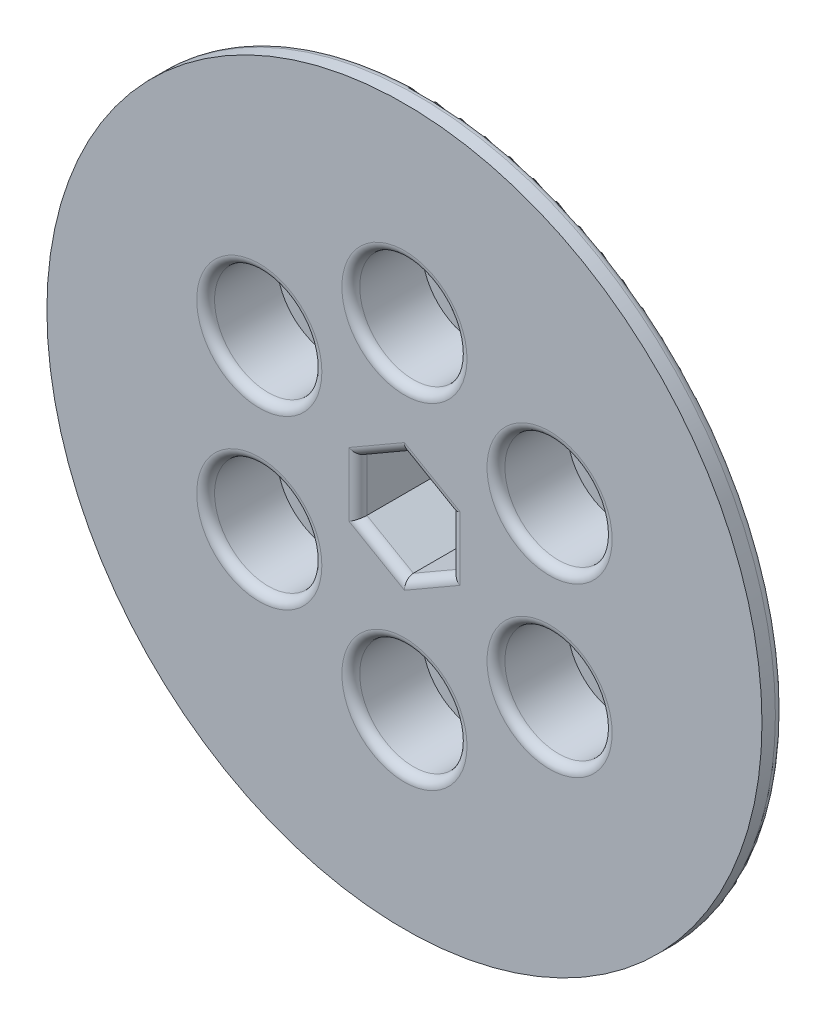
ISO-10303-21;
HEADER;
FILE_DESCRIPTION(('STEP AP214'),'2;1');
FILE_NAME('part.step','',(''),(''),'','','');
FILE_SCHEMA(('AUTOMOTIVE_DESIGN { 1 0 10303 214 1 1 1 1 }'));
ENDSEC;
DATA;
#1=APPLICATION_CONTEXT('core data for automotive mechanical design processes');
#2=APPLICATION_PROTOCOL_DEFINITION('international standard','automotive_design',2000,#1);
#3=PRODUCT_CONTEXT('',#1,'mechanical');
#4=PRODUCT('Part','Part','',(#3));
#5=PRODUCT_RELATED_PRODUCT_CATEGORY('part','',(#4));
#6=PRODUCT_DEFINITION_FORMATION('','',#4);
#7=PRODUCT_DEFINITION_CONTEXT('part definition',#1,'design');
#8=PRODUCT_DEFINITION('design','',#6,#7);
#9=PRODUCT_DEFINITION_SHAPE('','',#8);
#10=(LENGTH_UNIT() NAMED_UNIT(*) SI_UNIT(.MILLI.,.METRE.));
#11=(NAMED_UNIT(*) PLANE_ANGLE_UNIT() SI_UNIT($,.RADIAN.));
#12=(NAMED_UNIT(*) SI_UNIT($,.STERADIAN.) SOLID_ANGLE_UNIT());
#13=UNCERTAINTY_MEASURE_WITH_UNIT(LENGTH_MEASURE(1.E-05),#10,'distance_accuracy_value','');
#14=(GEOMETRIC_REPRESENTATION_CONTEXT(3) GLOBAL_UNCERTAINTY_ASSIGNED_CONTEXT((#13)) GLOBAL_UNIT_ASSIGNED_CONTEXT((#10,
#11,#12)) REPRESENTATION_CONTEXT('',''));
#15=CARTESIAN_POINT('',(0.,0.,0.));
#16=DIRECTION('',(0.,0.,1.));
#17=DIRECTION('',(1.,0.,0.));
#18=AXIS2_PLACEMENT_3D('',#15,#16,#17);
#19=CARTESIAN_POINT('',(20.6222299276166,11.9062499999994,15.876));
#20=DIRECTION('',(0.,0.,-1.));
#21=DIRECTION('',(-1.,0.,0.));
#22=AXIS2_PLACEMENT_3D('',#19,#20,#21);
#23=CYLINDRICAL_SURFACE('',#22,2.66700000000078);
#24=CARTESIAN_POINT('',(20.6222299276166,11.9062499999994,0.));
#25=DIRECTION('',(0.,0.,-1.));
#26=DIRECTION('',(-1.,0.,0.));
#27=AXIS2_PLACEMENT_3D('',#24,#25,#26);
#28=CIRCLE('',#27,2.66700000000078);
#29=CARTESIAN_POINT('',(17.9552299276158,11.9062499999994,0.));
#30=VERTEX_POINT('',#29);
#31=EDGE_CURVE('E165',#30,#30,#28,.T.);
#32=ORIENTED_EDGE('',*,*,#31,.T.);
#33=EDGE_LOOP('',(#32));
#34=FACE_BOUND('',#33,.T.);
#35=CARTESIAN_POINT('',(20.6222299276166,11.9062499999994,5.715));
#36=DIRECTION('',(0.,0.,1.));
#37=DIRECTION('',(1.,0.,0.));
#38=AXIS2_PLACEMENT_3D('',#35,#36,#37);
#39=CIRCLE('',#38,2.66700000000078);
#40=CARTESIAN_POINT('',(23.2892299276174,11.9062499999994,5.715));
#41=VERTEX_POINT('',#40);
#42=EDGE_CURVE('E168',#41,#41,#39,.F.);
#43=ORIENTED_EDGE('',*,*,#42,.F.);
#44=EDGE_LOOP('',(#43));
#45=FACE_BOUND('',#44,.T.);
#46=ADVANCED_FACE('F34',(#34,#45),#23,.F.);
#47=CARTESIAN_POINT('',(20.6222299276159,-11.9062500000006,15.876));
#48=DIRECTION('',(0.,0.,-1.));
#49=DIRECTION('',(-1.,0.,0.));
#50=AXIS2_PLACEMENT_3D('',#47,#48,#49);
#51=CYLINDRICAL_SURFACE('',#50,2.66700000000136);
#52=CARTESIAN_POINT('',(20.6222299276159,-11.9062500000006,0.));
#53=DIRECTION('',(0.,0.,-1.));
#54=DIRECTION('',(-1.,0.,0.));
#55=AXIS2_PLACEMENT_3D('',#52,#53,#54);
#56=CIRCLE('',#55,2.66700000000136);
#57=CARTESIAN_POINT('',(17.9552299276146,-11.9062500000006,0.));
#58=VERTEX_POINT('',#57);
#59=EDGE_CURVE('E162',#58,#58,#56,.T.);
#60=ORIENTED_EDGE('',*,*,#59,.T.);
#61=EDGE_LOOP('',(#60));
#62=FACE_BOUND('',#61,.T.);
#63=CARTESIAN_POINT('',(20.6222299276159,-11.9062500000006,5.715));
#64=DIRECTION('',(0.,0.,1.));
#65=DIRECTION('',(1.,0.,0.));
#66=AXIS2_PLACEMENT_3D('',#63,#64,#65);
#67=CIRCLE('',#66,2.66700000000136);
#68=CARTESIAN_POINT('',(23.2892299276173,-11.9062500000006,5.715));
#69=VERTEX_POINT('',#68);
#70=EDGE_CURVE('E193',#69,#69,#67,.F.);
#71=ORIENTED_EDGE('',*,*,#70,.F.);
#72=EDGE_LOOP('',(#71));
#73=FACE_BOUND('',#72,.T.);
#74=ADVANCED_FACE('F337',(#62,#73),#51,.F.);
#75=CARTESIAN_POINT('',(-1.34775153124205E-12,-23.8125,15.876));
#76=DIRECTION('',(0.,0.,-1.));
#77=DIRECTION('',(-1.,0.,0.));
#78=AXIS2_PLACEMENT_3D('',#75,#76,#77);
#79=CYLINDRICAL_SURFACE('',#78,2.66700000000145);
#80=CARTESIAN_POINT('',(-1.34775153124205E-12,-23.8125,0.));
#81=DIRECTION('',(0.,0.,-1.));
#82=DIRECTION('',(-1.,0.,0.));
#83=AXIS2_PLACEMENT_3D('',#80,#81,#82);
#84=CIRCLE('',#83,2.66700000000145);
#85=CARTESIAN_POINT('',(-2.6670000000028,-23.8125,0.));
#86=VERTEX_POINT('',#85);
#87=EDGE_CURVE('E159',#86,#86,#84,.T.);
#88=ORIENTED_EDGE('',*,*,#87,.T.);
#89=EDGE_LOOP('',(#88));
#90=FACE_BOUND('',#89,.T.);
#91=CARTESIAN_POINT('',(-1.34775153124205E-12,-23.8125,5.715));
#92=DIRECTION('',(0.,0.,1.));
#93=DIRECTION('',(1.,0.,0.));
#94=AXIS2_PLACEMENT_3D('',#91,#92,#93);
#95=CIRCLE('',#94,2.66700000000145);
#96=CARTESIAN_POINT('',(2.6670000000001,-23.8125,5.715));
#97=VERTEX_POINT('',#96);
#98=EDGE_CURVE('E190',#97,#97,#95,.F.);
#99=ORIENTED_EDGE('',*,*,#98,.F.);
#100=EDGE_LOOP('',(#99));
#101=FACE_BOUND('',#100,.T.);
#102=ADVANCED_FACE('F343',(#90,#101),#79,.F.);
#103=CARTESIAN_POINT('',(-20.622229927618,-11.9062499999994,15.876));
#104=DIRECTION('',(0.,0.,-1.));
#105=DIRECTION('',(-1.,0.,0.));
#106=AXIS2_PLACEMENT_3D('',#103,#104,#105);
#107=CYLINDRICAL_SURFACE('',#106,2.66700000000091);
#108=CARTESIAN_POINT('',(-20.622229927618,-11.9062499999994,0.));
#109=DIRECTION('',(0.,0.,-1.));
#110=DIRECTION('',(-1.,0.,0.));
#111=AXIS2_PLACEMENT_3D('',#108,#109,#110);
#112=CIRCLE('',#111,2.66700000000091);
#113=CARTESIAN_POINT('',(-23.2892299276189,-11.9062499999994,0.));
#114=VERTEX_POINT('',#113);
#115=EDGE_CURVE('E156',#114,#114,#112,.T.);
#116=ORIENTED_EDGE('',*,*,#115,.T.);
#117=EDGE_LOOP('',(#116));
#118=FACE_BOUND('',#117,.T.);
#119=CARTESIAN_POINT('',(-20.622229927618,-11.9062499999994,5.715));
#120=DIRECTION('',(0.,0.,1.));
#121=DIRECTION('',(1.,0.,0.));
#122=AXIS2_PLACEMENT_3D('',#119,#120,#121);
#123=CIRCLE('',#122,2.66700000000091);
#124=CARTESIAN_POINT('',(-17.9552299276171,-11.9062499999994,5.715));
#125=VERTEX_POINT('',#124);
#126=EDGE_CURVE('E187',#125,#125,#123,.F.);
#127=ORIENTED_EDGE('',*,*,#126,.F.);
#128=EDGE_LOOP('',(#127));
#129=FACE_BOUND('',#128,.T.);
#130=ADVANCED_FACE('F594',(#118,#129),#107,.F.);
#131=CARTESIAN_POINT('',(-20.6222299276173,11.9062500000006,15.876));
#132=DIRECTION('',(0.,0.,-1.));
#133=DIRECTION('',(-1.,0.,0.));
#134=AXIS2_PLACEMENT_3D('',#131,#132,#133);
#135=CYLINDRICAL_SURFACE('',#134,2.66700000000021);
#136=CARTESIAN_POINT('',(-20.6222299276173,11.9062500000006,0.));
#137=DIRECTION('',(0.,0.,-1.));
#138=DIRECTION('',(-1.,0.,0.));
#139=AXIS2_PLACEMENT_3D('',#136,#137,#138);
#140=CIRCLE('',#139,2.66700000000021);
#141=CARTESIAN_POINT('',(-23.2892299276175,11.9062500000006,0.));
#142=VERTEX_POINT('',#141);
#143=EDGE_CURVE('E153',#142,#142,#140,.T.);
#144=ORIENTED_EDGE('',*,*,#143,.T.);
#145=EDGE_LOOP('',(#144));
#146=FACE_BOUND('',#145,.T.);
#147=CARTESIAN_POINT('',(-20.6222299276173,11.9062500000006,5.715));
#148=DIRECTION('',(0.,0.,1.));
#149=DIRECTION('',(1.,0.,0.));
#150=AXIS2_PLACEMENT_3D('',#147,#148,#149);
#151=CIRCLE('',#150,2.66700000000021);
#152=CARTESIAN_POINT('',(-17.9552299276171,11.9062500000006,5.715));
#153=VERTEX_POINT('',#152);
#154=EDGE_CURVE('E183',#153,#153,#151,.F.);
#155=ORIENTED_EDGE('',*,*,#154,.F.);
#156=EDGE_LOOP('',(#155));
#157=FACE_BOUND('',#156,.T.);
#158=ADVANCED_FACE('F602',(#146,#157),#135,.F.);
#159=CARTESIAN_POINT('',(0.,23.8125,15.876));
#160=DIRECTION('',(0.,0.,-1.));
#161=DIRECTION('',(-1.,0.,0.));
#162=AXIS2_PLACEMENT_3D('',#159,#160,#161);
#163=CYLINDRICAL_SURFACE('',#162,2.667);
#164=CARTESIAN_POINT('',(0.,23.8125,0.));
#165=DIRECTION('',(0.,0.,-1.));
#166=DIRECTION('',(-1.,0.,0.));
#167=AXIS2_PLACEMENT_3D('',#164,#165,#166);
#168=CIRCLE('',#167,2.667);
#169=CARTESIAN_POINT('',(-2.667,23.8125,0.));
#170=VERTEX_POINT('',#169);
#171=EDGE_CURVE('E146',#170,#170,#168,.T.);
#172=ORIENTED_EDGE('',*,*,#171,.T.);
#173=EDGE_LOOP('',(#172));
#174=FACE_BOUND('',#173,.T.);
#175=CARTESIAN_POINT('',(0.,23.8125,5.715));
#176=DIRECTION('',(0.,0.,1.));
#177=DIRECTION('',(1.,0.,0.));
#178=AXIS2_PLACEMENT_3D('',#175,#176,#177);
#179=CIRCLE('',#178,2.667);
#180=CARTESIAN_POINT('',(2.667,23.8125,5.715));
#181=VERTEX_POINT('',#180);
#182=EDGE_CURVE('E180',#181,#181,#179,.F.);
#183=ORIENTED_EDGE('',*,*,#182,.F.);
#184=EDGE_LOOP('',(#183));
#185=FACE_BOUND('',#184,.T.);
#186=ADVANCED_FACE('F366',(#174,#185),#163,.F.);
#187=CARTESIAN_POINT('',(0.,0.,12.7));
#188=DIRECTION('',(0.,0.,-1.));
#189=DIRECTION('',(-1.,0.,0.));
#190=AXIS2_PLACEMENT_3D('',#187,#188,#189);
#191=CYLINDRICAL_SURFACE('',#190,31.75);
#192=CARTESIAN_POINT('',(0.,0.,12.7));
#193=DIRECTION('',(0.,0.,1.));
#194=DIRECTION('',(1.,0.,0.));
#195=AXIS2_PLACEMENT_3D('',#192,#193,#194);
#196=CIRCLE('',#195,31.75);
#197=CARTESIAN_POINT('',(31.75,0.,12.7));
#198=VERTEX_POINT('',#197);
#199=EDGE_CURVE('E174',#198,#198,#196,.T.);
#200=ORIENTED_EDGE('',*,*,#199,.F.);
#201=EDGE_LOOP('',(#200));
#202=FACE_BOUND('',#201,.T.);
#203=CARTESIAN_POINT('',(0.,0.,0.));
#204=DIRECTION('',(0.,0.,1.));
#205=DIRECTION('',(1.,0.,0.));
#206=AXIS2_PLACEMENT_3D('',#203,#204,#205);
#207=CIRCLE('',#206,31.75);
#208=CARTESIAN_POINT('',(31.75,0.,0.));
#209=VERTEX_POINT('',#208);
#210=EDGE_CURVE('E173',#209,#209,#207,.T.);
#211=ORIENTED_EDGE('',*,*,#210,.T.);
#212=EDGE_LOOP('',(#211));
#213=FACE_BOUND('',#212,.T.);
#214=ADVANCED_FACE('F362',(#202,#213),#191,.T.);
#215=CARTESIAN_POINT('',(0.,0.,0.));
#216=DIRECTION('',(0.,0.,1.));
#217=DIRECTION('',(1.,0.,0.));
#218=AXIS2_PLACEMENT_3D('',#215,#216,#217);
#219=PLANE('',#218);
#220=ORIENTED_EDGE('',*,*,#171,.F.);
#221=EDGE_LOOP('',(#220));
#222=FACE_BOUND('',#221,.T.);
#223=DIRECTION('',(0.866025403784439,-0.5,0.));
#224=VECTOR('',#223,1.);
#225=CARTESIAN_POINT('',(0.,7.62564235545658,0.));
#226=LINE('',#225,#224);
#227=CARTESIAN_POINT('',(0.,7.62564235545658,0.));
#228=VERTEX_POINT('',#227);
#229=CARTESIAN_POINT('',(6.604,3.81282117772829,0.));
#230=VERTEX_POINT('',#229);
#231=EDGE_CURVE('E121',#228,#230,#226,.T.);
#232=ORIENTED_EDGE('',*,*,#231,.F.);
#233=DIRECTION('',(0.866025403784438,0.5,0.));
#234=VECTOR('',#233,1.);
#235=CARTESIAN_POINT('',(-6.604,3.81282117772829,0.));
#236=LINE('',#235,#234);
#237=CARTESIAN_POINT('',(-6.604,3.81282117772829,0.));
#238=VERTEX_POINT('',#237);
#239=EDGE_CURVE('E127',#238,#228,#236,.T.);
#240=ORIENTED_EDGE('',*,*,#239,.F.);
#241=DIRECTION('',(0.,1.,0.));
#242=VECTOR('',#241,1.);
#243=CARTESIAN_POINT('',(-6.604,-3.81282117772829,0.));
#244=LINE('',#243,#242);
#245=CARTESIAN_POINT('',(-6.604,-3.81282117772829,0.));
#246=VERTEX_POINT('',#245);
#247=EDGE_CURVE('E141',#246,#238,#244,.T.);
#248=ORIENTED_EDGE('',*,*,#247,.F.);
#249=DIRECTION('',(-0.866025403784439,0.5,0.));
#250=VECTOR('',#249,1.);
#251=CARTESIAN_POINT('',(0.,-7.62564235545658,0.));
#252=LINE('',#251,#250);
#253=CARTESIAN_POINT('',(0.,-7.62564235545658,0.));
#254=VERTEX_POINT('',#253);
#255=EDGE_CURVE('E135',#254,#246,#252,.T.);
#256=ORIENTED_EDGE('',*,*,#255,.F.);
#257=DIRECTION('',(-0.866025403784438,-0.5,0.));
#258=VECTOR('',#257,1.);
#259=CARTESIAN_POINT('',(6.604,-3.81282117772829,0.));
#260=LINE('',#259,#258);
#261=CARTESIAN_POINT('',(6.604,-3.81282117772829,0.));
#262=VERTEX_POINT('',#261);
#263=EDGE_CURVE('E133',#262,#254,#260,.T.);
#264=ORIENTED_EDGE('',*,*,#263,.F.);
#265=DIRECTION('',(0.,-1.,0.));
#266=VECTOR('',#265,1.);
#267=CARTESIAN_POINT('',(6.604,3.81282117772829,0.));
#268=LINE('',#267,#266);
#269=EDGE_CURVE('E112',#230,#262,#268,.T.);
#270=ORIENTED_EDGE('',*,*,#269,.F.);
#271=EDGE_LOOP('',(#232,#240,#248,#256,#264,#270));
#272=FACE_BOUND('',#271,.T.);
#273=ORIENTED_EDGE('',*,*,#143,.F.);
#274=EDGE_LOOP('',(#273));
#275=FACE_BOUND('',#274,.T.);
#276=ORIENTED_EDGE('',*,*,#115,.F.);
#277=EDGE_LOOP('',(#276));
#278=FACE_BOUND('',#277,.T.);
#279=ORIENTED_EDGE('',*,*,#87,.F.);
#280=EDGE_LOOP('',(#279));
#281=FACE_BOUND('',#280,.T.);
#282=ORIENTED_EDGE('',*,*,#59,.F.);
#283=EDGE_LOOP('',(#282));
#284=FACE_BOUND('',#283,.T.);
#285=ORIENTED_EDGE('',*,*,#31,.F.);
#286=EDGE_LOOP('',(#285));
#287=FACE_BOUND('',#286,.T.);
#288=ORIENTED_EDGE('',*,*,#210,.F.);
#289=EDGE_LOOP('',(#288));
#290=FACE_BOUND('',#289,.T.);
#291=ADVANCED_FACE('F129',(#222,#272,#275,#278,#281,#284,#287,#290),#219,.F.);
#292=CARTESIAN_POINT('',(0.,0.,15.875));
#293=DIRECTION('',(0.,0.,-1.));
#294=DIRECTION('',(-1.,0.,0.));
#295=AXIS2_PLACEMENT_3D('',#292,#293,#294);
#296=CYLINDRICAL_SURFACE('',#295,50.8);
#297=CARTESIAN_POINT('',(0.,0.,13.97));
#298=DIRECTION('',(0.,0.,1.));
#299=DIRECTION('',(1.,0.,0.));
#300=AXIS2_PLACEMENT_3D('',#297,#298,#299);
#301=CIRCLE('',#300,50.8);
#302=CARTESIAN_POINT('',(50.8,0.,13.97));
#303=VERTEX_POINT('',#302);
#304=EDGE_CURVE('E177',#303,#303,#301,.T.);
#305=ORIENTED_EDGE('',*,*,#304,.T.);
#306=EDGE_LOOP('',(#305));
#307=FACE_BOUND('',#306,.T.);
#308=CARTESIAN_POINT('',(0.,0.,15.875));
#309=DIRECTION('',(0.,0.,1.));
#310=DIRECTION('',(1.,0.,0.));
#311=AXIS2_PLACEMENT_3D('',#308,#309,#310);
#312=CIRCLE('',#311,50.8);
#313=CARTESIAN_POINT('',(50.8,0.,15.875));
#314=VERTEX_POINT('',#313);
#315=EDGE_CURVE('E169',#314,#314,#312,.T.);
#316=ORIENTED_EDGE('',*,*,#315,.F.);
#317=EDGE_LOOP('',(#316));
#318=FACE_BOUND('',#317,.T.);
#319=ADVANCED_FACE('F352',(#307,#318),#296,.T.);
#320=CARTESIAN_POINT('',(0.,0.,15.875));
#321=DIRECTION('',(0.,0.,1.));
#322=DIRECTION('',(1.,0.,0.));
#323=AXIS2_PLACEMENT_3D('',#320,#321,#322);
#324=PLANE('',#323);
#325=CARTESIAN_POINT('',(-20.6222299276169,11.9062500000012,15.875));
#326=DIRECTION('',(0.,0.,1.));
#327=DIRECTION('',(1.,0.,0.));
#328=AXIS2_PLACEMENT_3D('',#325,#326,#327);
#329=CIRCLE('',#328,8.89);
#330=CARTESIAN_POINT('',(-11.7322299276169,11.9062500000012,15.875));
#331=VERTEX_POINT('',#330);
#332=EDGE_CURVE('E236',#331,#331,#329,.F.);
#333=ORIENTED_EDGE('',*,*,#332,.T.);
#334=EDGE_LOOP('',(#333));
#335=FACE_BOUND('',#334,.T.);
#336=CARTESIAN_POINT('',(1.12583553590895E-12,23.8125000000006,15.875));
#337=DIRECTION('',(0.,0.,1.));
#338=DIRECTION('',(1.,0.,0.));
#339=AXIS2_PLACEMENT_3D('',#336,#337,#338);
#340=CIRCLE('',#339,8.89);
#341=CARTESIAN_POINT('',(8.89000000000113,23.8125000000006,15.875));
#342=VERTEX_POINT('',#341);
#343=EDGE_CURVE('E233',#342,#342,#340,.F.);
#344=ORIENTED_EDGE('',*,*,#343,.T.);
#345=EDGE_LOOP('',(#344));
#346=FACE_BOUND('',#345,.T.);
#347=CARTESIAN_POINT('',(20.622229927618,11.9062499999993,15.875));
#348=DIRECTION('',(0.,0.,1.));
#349=DIRECTION('',(1.,0.,0.));
#350=AXIS2_PLACEMENT_3D('',#347,#348,#349);
#351=CIRCLE('',#350,8.89);
#352=CARTESIAN_POINT('',(29.512229927618,11.9062499999993,15.875));
#353=VERTEX_POINT('',#352);
#354=EDGE_CURVE('E230',#353,#353,#351,.F.);
#355=ORIENTED_EDGE('',*,*,#354,.T.);
#356=EDGE_LOOP('',(#355));
#357=FACE_BOUND('',#356,.T.);
#358=CARTESIAN_POINT('',(20.6222299276168,-11.9062500000014,15.875));
#359=DIRECTION('',(0.,0.,1.));
#360=DIRECTION('',(1.,0.,0.));
#361=AXIS2_PLACEMENT_3D('',#358,#359,#360);
#362=CIRCLE('',#361,8.89);
#363=CARTESIAN_POINT('',(29.5122299276168,-11.9062500000014,15.875));
#364=VERTEX_POINT('',#363);
#365=EDGE_CURVE('E227',#364,#364,#362,.F.);
#366=ORIENTED_EDGE('',*,*,#365,.T.);
#367=EDGE_LOOP('',(#366));
#368=FACE_BOUND('',#367,.T.);
#369=CARTESIAN_POINT('',(-20.622229927618,-11.9062499999994,15.875));
#370=DIRECTION('',(0.,0.,1.));
#371=DIRECTION('',(1.,0.,0.));
#372=AXIS2_PLACEMENT_3D('',#369,#370,#371);
#373=CIRCLE('',#372,8.89);
#374=CARTESIAN_POINT('',(-11.732229927618,-11.9062499999994,15.875));
#375=VERTEX_POINT('',#374);
#376=EDGE_CURVE('E224',#375,#375,#373,.F.);
#377=ORIENTED_EDGE('',*,*,#376,.T.);
#378=EDGE_LOOP('',(#377));
#379=FACE_BOUND('',#378,.T.);
#380=CARTESIAN_POINT('',(-1.29236898960272E-12,-23.8125000000006,15.875));
#381=DIRECTION('',(0.,0.,1.));
#382=DIRECTION('',(1.,0.,0.));
#383=AXIS2_PLACEMENT_3D('',#380,#381,#382);
#384=CIRCLE('',#383,8.89);
#385=CARTESIAN_POINT('',(8.88999999999871,-23.8125000000006,15.875));
#386=VERTEX_POINT('',#385);
#387=EDGE_CURVE('E221',#386,#386,#384,.F.);
#388=ORIENTED_EDGE('',*,*,#387,.T.);
#389=EDGE_LOOP('',(#388));
#390=FACE_BOUND('',#389,.T.);
#391=DIRECTION('',(0.866025403784439,-0.5,0.));
#392=VECTOR('',#391,1.);
#393=CARTESIAN_POINT('',(7.23900000000001,4.91267344053453,15.875));
#394=LINE('',#393,#392);
#395=CARTESIAN_POINT('',(0.,9.09211203919823,15.875));
#396=VERTEX_POINT('',#395);
#397=CARTESIAN_POINT('',(7.874,4.54605601959912,15.875));
#398=VERTEX_POINT('',#397);
#399=EDGE_CURVE('E216',#396,#398,#394,.T.);
#400=ORIENTED_EDGE('',*,*,#399,.T.);
#401=DIRECTION('',(0.,-1.,0.));
#402=VECTOR('',#401,1.);
#403=CARTESIAN_POINT('',(7.874,-3.81282117772829,15.875));
#404=LINE('',#403,#402);
#405=CARTESIAN_POINT('',(7.874,-4.54605601959911,15.875));
#406=VERTEX_POINT('',#405);
#407=EDGE_CURVE('E218',#398,#406,#404,.T.);
#408=ORIENTED_EDGE('',*,*,#407,.T.);
#409=DIRECTION('',(-0.866025403784439,-0.5,0.));
#410=VECTOR('',#409,1.);
#411=CARTESIAN_POINT('',(0.635,-8.72549461826282,15.875));
#412=LINE('',#411,#410);
#413=CARTESIAN_POINT('',(0.,-9.09211203919823,15.875));
#414=VERTEX_POINT('',#413);
#415=EDGE_CURVE('E208',#406,#414,#412,.T.);
#416=ORIENTED_EDGE('',*,*,#415,.T.);
#417=DIRECTION('',(-0.866025403784439,0.5,0.));
#418=VECTOR('',#417,1.);
#419=CARTESIAN_POINT('',(-7.239,-4.91267344053453,15.875));
#420=LINE('',#419,#418);
#421=CARTESIAN_POINT('',(-7.874,-4.54605601959911,15.875));
#422=VERTEX_POINT('',#421);
#423=EDGE_CURVE('E210',#414,#422,#420,.T.);
#424=ORIENTED_EDGE('',*,*,#423,.T.);
#425=DIRECTION('',(0.,1.,0.));
#426=VECTOR('',#425,1.);
#427=CARTESIAN_POINT('',(-7.874,3.81282117772829,15.875));
#428=LINE('',#427,#426);
#429=CARTESIAN_POINT('',(-7.874,4.54605601959912,15.875));
#430=VERTEX_POINT('',#429);
#431=EDGE_CURVE('E212',#422,#430,#428,.T.);
#432=ORIENTED_EDGE('',*,*,#431,.T.);
#433=DIRECTION('',(0.866025403784439,0.5,0.));
#434=VECTOR('',#433,1.);
#435=CARTESIAN_POINT('',(-0.635000000000003,8.72549461826282,15.875));
#436=LINE('',#435,#434);
#437=EDGE_CURVE('E214',#430,#396,#436,.T.);
#438=ORIENTED_EDGE('',*,*,#437,.T.);
#439=EDGE_LOOP('',(#400,#408,#416,#424,#432,#438));
#440=FACE_BOUND('',#439,.T.);
#441=ORIENTED_EDGE('',*,*,#315,.T.);
#442=EDGE_LOOP('',(#441));
#443=FACE_BOUND('',#442,.T.);
#444=ADVANCED_FACE('F320',(#335,#346,#357,#368,#379,#390,#440,#443),#324,.T.);
#445=CARTESIAN_POINT('',(0.,0.,12.7));
#446=DIRECTION('',(0.,0.,1.));
#447=DIRECTION('',(1.,0.,0.));
#448=AXIS2_PLACEMENT_3D('',#445,#446,#447);
#449=PLANE('',#448);
#450=CARTESIAN_POINT('',(0.,0.,12.7));
#451=DIRECTION('',(0.,0.,1.));
#452=DIRECTION('',(1.,0.,0.));
#453=AXIS2_PLACEMENT_3D('',#450,#451,#452);
#454=CIRCLE('',#453,49.53);
#455=CARTESIAN_POINT('',(49.53,0.,12.7));
#456=VERTEX_POINT('',#455);
#457=EDGE_CURVE('E201',#456,#456,#454,.F.);
#458=ORIENTED_EDGE('',*,*,#457,.T.);
#459=EDGE_LOOP('',(#458));
#460=FACE_BOUND('',#459,.T.);
#461=ORIENTED_EDGE('',*,*,#199,.T.);
#462=EDGE_LOOP('',(#461));
#463=FACE_BOUND('',#462,.T.);
#464=ADVANCED_FACE('F351',(#460,#463),#449,.F.);
#465=CARTESIAN_POINT('',(-6.604,3.81282117772829,15.876));
#466=DIRECTION('',(-0.5,0.866025403784439,0.));
#467=DIRECTION('',(-0.866025403784439,-0.5,0.));
#468=AXIS2_PLACEMENT_3D('',#465,#466,#467);
#469=PLANE('',#468);
#470=DIRECTION('',(0.,0.,-1.));
#471=VECTOR('',#470,1.);
#472=CARTESIAN_POINT('',(0.,7.62564235545658,15.876));
#473=LINE('',#472,#471);
#474=CARTESIAN_POINT('',(0.,7.62564235545658,14.605));
#475=VERTEX_POINT('',#474);
#476=EDGE_CURVE('E118',#475,#228,#473,.T.);
#477=ORIENTED_EDGE('',*,*,#476,.F.);
#478=DIRECTION('',(0.866025403784439,0.5,0.));
#479=VECTOR('',#478,1.);
#480=CARTESIAN_POINT('',(-6.604,3.81282117772829,14.605));
#481=LINE('',#480,#479);
#482=CARTESIAN_POINT('',(-6.604,3.81282117772829,14.605));
#483=VERTEX_POINT('',#482);
#484=EDGE_CURVE('E257',#475,#483,#481,.F.);
#485=ORIENTED_EDGE('',*,*,#484,.T.);
#486=DIRECTION('',(0.,0.,-1.));
#487=VECTOR('',#486,1.);
#488=CARTESIAN_POINT('',(-6.604,3.81282117772829,15.876));
#489=LINE('',#488,#487);
#490=EDGE_CURVE('E144',#483,#238,#489,.T.);
#491=ORIENTED_EDGE('',*,*,#490,.T.);
#492=ORIENTED_EDGE('',*,*,#239,.T.);
#493=EDGE_LOOP('',(#477,#485,#491,#492));
#494=FACE_BOUND('',#493,.T.);
#495=ADVANCED_FACE('F302',(#494),#469,.F.);
#496=CARTESIAN_POINT('',(-6.604,-3.81282117772829,15.876));
#497=DIRECTION('',(-1.,0.,0.));
#498=DIRECTION('',(0.,0.,1.));
#499=AXIS2_PLACEMENT_3D('',#496,#497,#498);
#500=PLANE('',#499);
#501=ORIENTED_EDGE('',*,*,#490,.F.);
#502=DIRECTION('',(0.,1.,0.));
#503=VECTOR('',#502,1.);
#504=CARTESIAN_POINT('',(-6.604,-3.81282117772829,14.605));
#505=LINE('',#504,#503);
#506=CARTESIAN_POINT('',(-6.604,-3.81282117772829,14.605));
#507=VERTEX_POINT('',#506);
#508=EDGE_CURVE('E58',#483,#507,#505,.F.);
#509=ORIENTED_EDGE('',*,*,#508,.T.);
#510=DIRECTION('',(0.,0.,-1.));
#511=VECTOR('',#510,1.);
#512=CARTESIAN_POINT('',(-6.604,-3.81282117772829,15.876));
#513=LINE('',#512,#511);
#514=EDGE_CURVE('E147',#507,#246,#513,.T.);
#515=ORIENTED_EDGE('',*,*,#514,.T.);
#516=ORIENTED_EDGE('',*,*,#247,.T.);
#517=EDGE_LOOP('',(#501,#509,#515,#516));
#518=FACE_BOUND('',#517,.T.);
#519=ADVANCED_FACE('F304',(#518),#500,.F.);
#520=CARTESIAN_POINT('',(0.,-7.62564235545658,15.876));
#521=DIRECTION('',(-0.5,-0.866025403784439,0.));
#522=DIRECTION('',(0.866025403784439,-0.5,0.));
#523=AXIS2_PLACEMENT_3D('',#520,#521,#522);
#524=PLANE('',#523);
#525=ORIENTED_EDGE('',*,*,#514,.F.);
#526=DIRECTION('',(-0.866025403784439,0.5,0.));
#527=VECTOR('',#526,1.);
#528=CARTESIAN_POINT('',(0.,-7.62564235545658,14.605));
#529=LINE('',#528,#527);
#530=CARTESIAN_POINT('',(0.,-7.62564235545658,14.605));
#531=VERTEX_POINT('',#530);
#532=EDGE_CURVE('E43',#507,#531,#529,.F.);
#533=ORIENTED_EDGE('',*,*,#532,.T.);
#534=DIRECTION('',(0.,0.,-1.));
#535=VECTOR('',#534,1.);
#536=CARTESIAN_POINT('',(0.,-7.62564235545658,15.876));
#537=LINE('',#536,#535);
#538=EDGE_CURVE('E149',#531,#254,#537,.T.);
#539=ORIENTED_EDGE('',*,*,#538,.T.);
#540=ORIENTED_EDGE('',*,*,#255,.T.);
#541=EDGE_LOOP('',(#525,#533,#539,#540));
#542=FACE_BOUND('',#541,.T.);
#543=ADVANCED_FACE('F305',(#542),#524,.F.);
#544=CARTESIAN_POINT('',(6.604,-3.81282117772829,15.876));
#545=DIRECTION('',(0.5,-0.866025403784438,0.));
#546=DIRECTION('',(0.866025403784439,0.5,0.));
#547=AXIS2_PLACEMENT_3D('',#544,#545,#546);
#548=PLANE('',#547);
#549=ORIENTED_EDGE('',*,*,#538,.F.);
#550=DIRECTION('',(-0.866025403784439,-0.5,0.));
#551=VECTOR('',#550,1.);
#552=CARTESIAN_POINT('',(6.60400000000001,-3.81282117772829,14.605));
#553=LINE('',#552,#551);
#554=CARTESIAN_POINT('',(6.604,-3.81282117772829,14.605));
#555=VERTEX_POINT('',#554);
#556=EDGE_CURVE('E11',#531,#555,#553,.F.);
#557=ORIENTED_EDGE('',*,*,#556,.T.);
#558=DIRECTION('',(0.,0.,-1.));
#559=VECTOR('',#558,1.);
#560=CARTESIAN_POINT('',(6.604,-3.81282117772829,15.876));
#561=LINE('',#560,#559);
#562=EDGE_CURVE('E117',#555,#262,#561,.T.);
#563=ORIENTED_EDGE('',*,*,#562,.T.);
#564=ORIENTED_EDGE('',*,*,#263,.T.);
#565=EDGE_LOOP('',(#549,#557,#563,#564));
#566=FACE_BOUND('',#565,.T.);
#567=ADVANCED_FACE('F308',(#566),#548,.F.);
#568=CARTESIAN_POINT('',(6.604,3.81282117772829,15.876));
#569=DIRECTION('',(1.,0.,0.));
#570=DIRECTION('',(0.,1.,0.));
#571=AXIS2_PLACEMENT_3D('',#568,#569,#570);
#572=PLANE('',#571);
#573=ORIENTED_EDGE('',*,*,#562,.F.);
#574=DIRECTION('',(0.,-1.,0.));
#575=VECTOR('',#574,1.);
#576=CARTESIAN_POINT('',(6.604,3.81282117772829,14.605));
#577=LINE('',#576,#575);
#578=CARTESIAN_POINT('',(6.604,3.81282117772829,14.605));
#579=VERTEX_POINT('',#578);
#580=EDGE_CURVE('E115',#555,#579,#577,.F.);
#581=ORIENTED_EDGE('',*,*,#580,.T.);
#582=DIRECTION('',(0.,0.,-1.));
#583=VECTOR('',#582,1.);
#584=CARTESIAN_POINT('',(6.604,3.81282117772829,15.876));
#585=LINE('',#584,#583);
#586=EDGE_CURVE('E107',#579,#230,#585,.T.);
#587=ORIENTED_EDGE('',*,*,#586,.T.);
#588=ORIENTED_EDGE('',*,*,#269,.T.);
#589=EDGE_LOOP('',(#573,#581,#587,#588));
#590=FACE_BOUND('',#589,.T.);
#591=ADVANCED_FACE('F110',(#590),#572,.F.);
#592=CARTESIAN_POINT('',(0.,7.62564235545658,15.876));
#593=DIRECTION('',(0.5,0.866025403784439,0.));
#594=DIRECTION('',(-0.866025403784439,0.5,0.));
#595=AXIS2_PLACEMENT_3D('',#592,#593,#594);
#596=PLANE('',#595);
#597=ORIENTED_EDGE('',*,*,#586,.F.);
#598=DIRECTION('',(0.866025403784439,-0.5,0.));
#599=VECTOR('',#598,1.);
#600=CARTESIAN_POINT('',(0.,7.62564235545658,14.605));
#601=LINE('',#600,#599);
#602=EDGE_CURVE('E255',#579,#475,#601,.F.);
#603=ORIENTED_EDGE('',*,*,#602,.T.);
#604=ORIENTED_EDGE('',*,*,#476,.T.);
#605=ORIENTED_EDGE('',*,*,#231,.T.);
#606=EDGE_LOOP('',(#597,#603,#604,#605));
#607=FACE_BOUND('',#606,.T.);
#608=ADVANCED_FACE('F122',(#607),#596,.F.);
#609=CARTESIAN_POINT('',(1.12583553590895E-12,23.8125000000006,5.715));
#610=DIRECTION('',(0.,0.,1.));
#611=DIRECTION('',(1.,0.,0.));
#612=AXIS2_PLACEMENT_3D('',#609,#610,#611);
#613=PLANE('',#612);
#614=CARTESIAN_POINT('',(1.12583553590895E-12,23.8125000000006,5.715));
#615=DIRECTION('',(0.,0.,1.));
#616=DIRECTION('',(1.,0.,0.));
#617=AXIS2_PLACEMENT_3D('',#614,#615,#616);
#618=CIRCLE('',#617,7.62);
#619=CARTESIAN_POINT('',(7.62000000000113,23.8125000000006,5.715));
#620=VERTEX_POINT('',#619);
#621=EDGE_CURVE('E293',#620,#620,#618,.T.);
#622=ORIENTED_EDGE('',*,*,#621,.T.);
#623=EDGE_LOOP('',(#622));
#624=FACE_BOUND('',#623,.T.);
#625=ORIENTED_EDGE('',*,*,#182,.T.);
#626=EDGE_LOOP('',(#625));
#627=FACE_BOUND('',#626,.T.);
#628=ADVANCED_FACE('F566',(#624,#627),#613,.T.);
#629=CARTESIAN_POINT('',(1.12583553590895E-12,23.8125000000006,5.715));
#630=DIRECTION('',(0.,0.,1.));
#631=DIRECTION('',(1.,0.,0.));
#632=AXIS2_PLACEMENT_3D('',#629,#630,#631);
#633=CYLINDRICAL_SURFACE('',#632,7.62);
#634=CARTESIAN_POINT('',(1.12583553590895E-12,23.8125000000006,14.605));
#635=DIRECTION('',(0.,0.,1.));
#636=DIRECTION('',(1.,0.,0.));
#637=AXIS2_PLACEMENT_3D('',#634,#635,#636);
#638=CIRCLE('',#637,7.62);
#639=CARTESIAN_POINT('',(7.62000000000113,23.8125000000006,14.605));
#640=VERTEX_POINT('',#639);
#641=EDGE_CURVE('E239',#640,#640,#638,.T.);
#642=ORIENTED_EDGE('',*,*,#641,.T.);
#643=EDGE_LOOP('',(#642));
#644=FACE_BOUND('',#643,.T.);
#645=ORIENTED_EDGE('',*,*,#621,.F.);
#646=EDGE_LOOP('',(#645));
#647=FACE_BOUND('',#646,.T.);
#648=ADVANCED_FACE('F557',(#644,#647),#633,.F.);
#649=CARTESIAN_POINT('',(-20.6222299276169,11.9062500000012,5.715));
#650=DIRECTION('',(0.,0.,1.));
#651=DIRECTION('',(1.,0.,0.));
#652=AXIS2_PLACEMENT_3D('',#649,#650,#651);
#653=PLANE('',#652);
#654=CARTESIAN_POINT('',(-20.6222299276169,11.9062500000012,5.715));
#655=DIRECTION('',(0.,0.,1.));
#656=DIRECTION('',(1.,0.,0.));
#657=AXIS2_PLACEMENT_3D('',#654,#655,#656);
#658=CIRCLE('',#657,7.62);
#659=CARTESIAN_POINT('',(-13.0022299276169,11.9062500000012,5.715));
#660=VERTEX_POINT('',#659);
#661=EDGE_CURVE('E290',#660,#660,#658,.T.);
#662=ORIENTED_EDGE('',*,*,#661,.T.);
#663=EDGE_LOOP('',(#662));
#664=FACE_BOUND('',#663,.T.);
#665=ORIENTED_EDGE('',*,*,#154,.T.);
#666=EDGE_LOOP('',(#665));
#667=FACE_BOUND('',#666,.T.);
#668=ADVANCED_FACE('F548',(#664,#667),#653,.T.);
#669=CARTESIAN_POINT('',(-20.6222299276169,11.9062500000012,5.715));
#670=DIRECTION('',(0.,0.,1.));
#671=DIRECTION('',(1.,0.,0.));
#672=AXIS2_PLACEMENT_3D('',#669,#670,#671);
#673=CYLINDRICAL_SURFACE('',#672,7.62);
#674=CARTESIAN_POINT('',(-20.6222299276169,11.9062500000012,14.605));
#675=DIRECTION('',(0.,0.,1.));
#676=DIRECTION('',(1.,0.,0.));
#677=AXIS2_PLACEMENT_3D('',#674,#675,#676);
#678=CIRCLE('',#677,7.62);
#679=CARTESIAN_POINT('',(-13.0022299276169,11.9062500000012,14.605));
#680=VERTEX_POINT('',#679);
#681=EDGE_CURVE('E205',#680,#680,#678,.T.);
#682=ORIENTED_EDGE('',*,*,#681,.T.);
#683=EDGE_LOOP('',(#682));
#684=FACE_BOUND('',#683,.T.);
#685=ORIENTED_EDGE('',*,*,#661,.F.);
#686=EDGE_LOOP('',(#685));
#687=FACE_BOUND('',#686,.T.);
#688=ADVANCED_FACE('F539',(#684,#687),#673,.F.);
#689=CARTESIAN_POINT('',(-20.622229927618,-11.9062499999994,5.715));
#690=DIRECTION('',(0.,0.,1.));
#691=DIRECTION('',(1.,0.,0.));
#692=AXIS2_PLACEMENT_3D('',#689,#690,#691);
#693=PLANE('',#692);
#694=CARTESIAN_POINT('',(-20.622229927618,-11.9062499999994,5.715));
#695=DIRECTION('',(0.,0.,1.));
#696=DIRECTION('',(1.,0.,0.));
#697=AXIS2_PLACEMENT_3D('',#694,#695,#696);
#698=CIRCLE('',#697,7.62);
#699=CARTESIAN_POINT('',(-13.002229927618,-11.9062499999994,5.715));
#700=VERTEX_POINT('',#699);
#701=EDGE_CURVE('E184',#700,#700,#698,.T.);
#702=ORIENTED_EDGE('',*,*,#701,.T.);
#703=EDGE_LOOP('',(#702));
#704=FACE_BOUND('',#703,.T.);
#705=ORIENTED_EDGE('',*,*,#126,.T.);
#706=EDGE_LOOP('',(#705));
#707=FACE_BOUND('',#706,.T.);
#708=ADVANCED_FACE('F530',(#704,#707),#693,.T.);
#709=CARTESIAN_POINT('',(-20.622229927618,-11.9062499999994,5.715));
#710=DIRECTION('',(0.,0.,1.));
#711=DIRECTION('',(1.,0.,0.));
#712=AXIS2_PLACEMENT_3D('',#709,#710,#711);
#713=CYLINDRICAL_SURFACE('',#712,7.62);
#714=CARTESIAN_POINT('',(-20.622229927618,-11.9062499999994,14.605));
#715=DIRECTION('',(0.,0.,1.));
#716=DIRECTION('',(1.,0.,0.));
#717=AXIS2_PLACEMENT_3D('',#714,#715,#716);
#718=CIRCLE('',#717,7.62);
#719=CARTESIAN_POINT('',(-13.002229927618,-11.9062499999994,14.605));
#720=VERTEX_POINT('',#719);
#721=EDGE_CURVE('E248',#720,#720,#718,.T.);
#722=ORIENTED_EDGE('',*,*,#721,.T.);
#723=EDGE_LOOP('',(#722));
#724=FACE_BOUND('',#723,.T.);
#725=ORIENTED_EDGE('',*,*,#701,.F.);
#726=EDGE_LOOP('',(#725));
#727=FACE_BOUND('',#726,.T.);
#728=ADVANCED_FACE('F522',(#724,#727),#713,.F.);
#729=CARTESIAN_POINT('',(-1.29236898960272E-12,-23.8125000000006,5.715));
#730=DIRECTION('',(0.,0.,1.));
#731=DIRECTION('',(1.,0.,0.));
#732=AXIS2_PLACEMENT_3D('',#729,#730,#731);
#733=PLANE('',#732);
#734=CARTESIAN_POINT('',(-1.29236898960272E-12,-23.8125000000006,5.715));
#735=DIRECTION('',(0.,0.,1.));
#736=DIRECTION('',(1.,0.,0.));
#737=AXIS2_PLACEMENT_3D('',#734,#735,#736);
#738=CIRCLE('',#737,7.62);
#739=CARTESIAN_POINT('',(7.61999999999871,-23.8125000000006,5.715));
#740=VERTEX_POINT('',#739);
#741=EDGE_CURVE('E276',#740,#740,#738,.T.);
#742=ORIENTED_EDGE('',*,*,#741,.T.);
#743=EDGE_LOOP('',(#742));
#744=FACE_BOUND('',#743,.T.);
#745=ORIENTED_EDGE('',*,*,#98,.T.);
#746=EDGE_LOOP('',(#745));
#747=FACE_BOUND('',#746,.T.);
#748=ADVANCED_FACE('F513',(#744,#747),#733,.T.);
#749=CARTESIAN_POINT('',(-1.29236898960272E-12,-23.8125000000006,5.715));
#750=DIRECTION('',(0.,0.,1.));
#751=DIRECTION('',(1.,0.,0.));
#752=AXIS2_PLACEMENT_3D('',#749,#750,#751);
#753=CYLINDRICAL_SURFACE('',#752,7.62);
#754=CARTESIAN_POINT('',(-1.29236898960272E-12,-23.8125000000006,14.605));
#755=DIRECTION('',(0.,0.,1.));
#756=DIRECTION('',(1.,0.,0.));
#757=AXIS2_PLACEMENT_3D('',#754,#755,#756);
#758=CIRCLE('',#757,7.62);
#759=CARTESIAN_POINT('',(7.61999999999871,-23.8125000000006,14.605));
#760=VERTEX_POINT('',#759);
#761=EDGE_CURVE('E251',#760,#760,#758,.T.);
#762=ORIENTED_EDGE('',*,*,#761,.T.);
#763=EDGE_LOOP('',(#762));
#764=FACE_BOUND('',#763,.T.);
#765=ORIENTED_EDGE('',*,*,#741,.F.);
#766=EDGE_LOOP('',(#765));
#767=FACE_BOUND('',#766,.T.);
#768=ADVANCED_FACE('F504',(#764,#767),#753,.F.);
#769=CARTESIAN_POINT('',(20.6222299276168,-11.9062500000014,5.715));
#770=DIRECTION('',(0.,0.,1.));
#771=DIRECTION('',(1.,0.,0.));
#772=AXIS2_PLACEMENT_3D('',#769,#770,#771);
#773=PLANE('',#772);
#774=CARTESIAN_POINT('',(20.6222299276168,-11.9062500000014,5.715));
#775=DIRECTION('',(0.,0.,1.));
#776=DIRECTION('',(1.,0.,0.));
#777=AXIS2_PLACEMENT_3D('',#774,#775,#776);
#778=CIRCLE('',#777,7.62);
#779=CARTESIAN_POINT('',(28.2422299276168,-11.9062500000014,5.715));
#780=VERTEX_POINT('',#779);
#781=EDGE_CURVE('E282',#780,#780,#778,.T.);
#782=ORIENTED_EDGE('',*,*,#781,.T.);
#783=EDGE_LOOP('',(#782));
#784=FACE_BOUND('',#783,.T.);
#785=ORIENTED_EDGE('',*,*,#70,.T.);
#786=EDGE_LOOP('',(#785));
#787=FACE_BOUND('',#786,.T.);
#788=ADVANCED_FACE('F495',(#784,#787),#773,.T.);
#789=CARTESIAN_POINT('',(20.6222299276168,-11.9062500000014,5.715));
#790=DIRECTION('',(0.,0.,1.));
#791=DIRECTION('',(1.,0.,0.));
#792=AXIS2_PLACEMENT_3D('',#789,#790,#791);
#793=CYLINDRICAL_SURFACE('',#792,7.62);
#794=CARTESIAN_POINT('',(20.6222299276168,-11.9062500000014,14.605));
#795=DIRECTION('',(0.,0.,1.));
#796=DIRECTION('',(1.,0.,0.));
#797=AXIS2_PLACEMENT_3D('',#794,#795,#796);
#798=CIRCLE('',#797,7.62);
#799=CARTESIAN_POINT('',(28.2422299276168,-11.9062500000014,14.605));
#800=VERTEX_POINT('',#799);
#801=EDGE_CURVE('E245',#800,#800,#798,.T.);
#802=ORIENTED_EDGE('',*,*,#801,.T.);
#803=EDGE_LOOP('',(#802));
#804=FACE_BOUND('',#803,.T.);
#805=ORIENTED_EDGE('',*,*,#781,.F.);
#806=EDGE_LOOP('',(#805));
#807=FACE_BOUND('',#806,.T.);
#808=ADVANCED_FACE('F485',(#804,#807),#793,.F.);
#809=CARTESIAN_POINT('',(20.622229927618,11.9062499999993,5.715));
#810=DIRECTION('',(0.,0.,1.));
#811=DIRECTION('',(1.,0.,0.));
#812=AXIS2_PLACEMENT_3D('',#809,#810,#811);
#813=PLANE('',#812);
#814=CARTESIAN_POINT('',(20.622229927618,11.9062499999993,5.715));
#815=DIRECTION('',(0.,0.,1.));
#816=DIRECTION('',(1.,0.,0.));
#817=AXIS2_PLACEMENT_3D('',#814,#815,#816);
#818=CIRCLE('',#817,7.62);
#819=CARTESIAN_POINT('',(28.242229927618,11.9062499999993,5.715));
#820=VERTEX_POINT('',#819);
#821=EDGE_CURVE('E287',#820,#820,#818,.T.);
#822=ORIENTED_EDGE('',*,*,#821,.T.);
#823=EDGE_LOOP('',(#822));
#824=FACE_BOUND('',#823,.T.);
#825=ORIENTED_EDGE('',*,*,#42,.T.);
#826=EDGE_LOOP('',(#825));
#827=FACE_BOUND('',#826,.T.);
#828=ADVANCED_FACE('F475',(#824,#827),#813,.T.);
#829=CARTESIAN_POINT('',(20.622229927618,11.9062499999993,5.715));
#830=DIRECTION('',(0.,0.,1.));
#831=DIRECTION('',(1.,0.,0.));
#832=AXIS2_PLACEMENT_3D('',#829,#830,#831);
#833=CYLINDRICAL_SURFACE('',#832,7.62);
#834=CARTESIAN_POINT('',(20.622229927618,11.9062499999993,14.605));
#835=DIRECTION('',(0.,0.,1.));
#836=DIRECTION('',(1.,0.,0.));
#837=AXIS2_PLACEMENT_3D('',#834,#835,#836);
#838=CIRCLE('',#837,7.62);
#839=CARTESIAN_POINT('',(28.242229927618,11.9062499999993,14.605));
#840=VERTEX_POINT('',#839);
#841=EDGE_CURVE('E242',#840,#840,#838,.T.);
#842=ORIENTED_EDGE('',*,*,#841,.T.);
#843=EDGE_LOOP('',(#842));
#844=FACE_BOUND('',#843,.T.);
#845=ORIENTED_EDGE('',*,*,#821,.F.);
#846=EDGE_LOOP('',(#845));
#847=FACE_BOUND('',#846,.T.);
#848=ADVANCED_FACE('F372',(#844,#847),#833,.F.);
#849=CARTESIAN_POINT('',(0.,0.,13.97));
#850=DIRECTION('',(0.,0.,1.));
#851=DIRECTION('',(1.,0.,0.));
#852=AXIS2_PLACEMENT_3D('',#849,#850,#851);
#853=TOROIDAL_SURFACE('',#852,49.53,1.27);
#854=ORIENTED_EDGE('',*,*,#457,.F.);
#855=EDGE_LOOP('',(#854));
#856=FACE_BOUND('',#855,.T.);
#857=ORIENTED_EDGE('',*,*,#304,.F.);
#858=EDGE_LOOP('',(#857));
#859=FACE_BOUND('',#858,.T.);
#860=ADVANCED_FACE('F368',(#856,#859),#853,.T.);
#861=CARTESIAN_POINT('',(-20.6222299276169,11.9062500000012,14.605));
#862=DIRECTION('',(0.,0.,1.));
#863=DIRECTION('',(1.,0.,0.));
#864=AXIS2_PLACEMENT_3D('',#861,#862,#863);
#865=TOROIDAL_SURFACE('',#864,8.89,1.27);
#866=ORIENTED_EDGE('',*,*,#332,.F.);
#867=EDGE_LOOP('',(#866));
#868=FACE_BOUND('',#867,.T.);
#869=ORIENTED_EDGE('',*,*,#681,.F.);
#870=EDGE_LOOP('',(#869));
#871=FACE_BOUND('',#870,.T.);
#872=ADVANCED_FACE('F371',(#868,#871),#865,.T.);
#873=CARTESIAN_POINT('',(1.12583553590895E-12,23.8125000000006,14.605));
#874=DIRECTION('',(0.,0.,1.));
#875=DIRECTION('',(1.,0.,0.));
#876=AXIS2_PLACEMENT_3D('',#873,#874,#875);
#877=TOROIDAL_SURFACE('',#876,8.89,1.27);
#878=ORIENTED_EDGE('',*,*,#343,.F.);
#879=EDGE_LOOP('',(#878));
#880=FACE_BOUND('',#879,.T.);
#881=ORIENTED_EDGE('',*,*,#641,.F.);
#882=EDGE_LOOP('',(#881));
#883=FACE_BOUND('',#882,.T.);
#884=ADVANCED_FACE('F376',(#880,#883),#877,.T.);
#885=CARTESIAN_POINT('',(20.622229927618,11.9062499999993,14.605));
#886=DIRECTION('',(0.,0.,1.));
#887=DIRECTION('',(1.,0.,0.));
#888=AXIS2_PLACEMENT_3D('',#885,#886,#887);
#889=TOROIDAL_SURFACE('',#888,8.89,1.27);
#890=ORIENTED_EDGE('',*,*,#354,.F.);
#891=EDGE_LOOP('',(#890));
#892=FACE_BOUND('',#891,.T.);
#893=ORIENTED_EDGE('',*,*,#841,.F.);
#894=EDGE_LOOP('',(#893));
#895=FACE_BOUND('',#894,.T.);
#896=ADVANCED_FACE('F380',(#892,#895),#889,.T.);
#897=CARTESIAN_POINT('',(20.6222299276168,-11.9062500000014,14.605));
#898=DIRECTION('',(0.,0.,1.));
#899=DIRECTION('',(1.,0.,0.));
#900=AXIS2_PLACEMENT_3D('',#897,#898,#899);
#901=TOROIDAL_SURFACE('',#900,8.89,1.27);
#902=ORIENTED_EDGE('',*,*,#365,.F.);
#903=EDGE_LOOP('',(#902));
#904=FACE_BOUND('',#903,.T.);
#905=ORIENTED_EDGE('',*,*,#801,.F.);
#906=EDGE_LOOP('',(#905));
#907=FACE_BOUND('',#906,.T.);
#908=ADVANCED_FACE('F384',(#904,#907),#901,.T.);
#909=CARTESIAN_POINT('',(-20.622229927618,-11.9062499999994,14.605));
#910=DIRECTION('',(0.,0.,1.));
#911=DIRECTION('',(1.,0.,0.));
#912=AXIS2_PLACEMENT_3D('',#909,#910,#911);
#913=TOROIDAL_SURFACE('',#912,8.89,1.27);
#914=ORIENTED_EDGE('',*,*,#376,.F.);
#915=EDGE_LOOP('',(#914));
#916=FACE_BOUND('',#915,.T.);
#917=ORIENTED_EDGE('',*,*,#721,.F.);
#918=EDGE_LOOP('',(#917));
#919=FACE_BOUND('',#918,.T.);
#920=ADVANCED_FACE('F388',(#916,#919),#913,.T.);
#921=CARTESIAN_POINT('',(-1.29236898960272E-12,-23.8125000000006,14.605));
#922=DIRECTION('',(0.,0.,1.));
#923=DIRECTION('',(1.,0.,0.));
#924=AXIS2_PLACEMENT_3D('',#921,#922,#923);
#925=TOROIDAL_SURFACE('',#924,8.89,1.27);
#926=ORIENTED_EDGE('',*,*,#387,.F.);
#927=EDGE_LOOP('',(#926));
#928=FACE_BOUND('',#927,.T.);
#929=ORIENTED_EDGE('',*,*,#761,.F.);
#930=EDGE_LOOP('',(#929));
#931=FACE_BOUND('',#930,.T.);
#932=ADVANCED_FACE('F334',(#928,#931),#925,.T.);
#933=CARTESIAN_POINT('',(-7.874,0.,14.605));
#934=DIRECTION('',(0.,-1.,0.));
#935=DIRECTION('',(0.,0.,-1.));
#936=AXIS2_PLACEMENT_3D('',#933,#934,#935);
#937=CYLINDRICAL_SURFACE('',#936,1.27);
#938=CARTESIAN_POINT('',(-7.874,-4.54605601959911,14.605));
#939=DIRECTION('',(0.5,-0.866025403784439,0.));
#940=DIRECTION('',(-0.866025403784439,-0.5,0.));
#941=AXIS2_PLACEMENT_3D('',#938,#939,#940);
#942=ELLIPSE('',#941,1.46646968374165,1.27);
#943=EDGE_CURVE('E270',#507,#422,#942,.T.);
#944=ORIENTED_EDGE('',*,*,#943,.F.);
#945=ORIENTED_EDGE('',*,*,#508,.F.);
#946=CARTESIAN_POINT('',(-7.874,4.54605601959912,14.605));
#947=DIRECTION('',(-0.5,-0.866025403784439,0.));
#948=DIRECTION('',(-0.866025403784439,0.5,0.));
#949=AXIS2_PLACEMENT_3D('',#946,#947,#948);
#950=ELLIPSE('',#949,1.46646968374165,1.27);
#951=EDGE_CURVE('E38',#430,#483,#950,.F.);
#952=ORIENTED_EDGE('',*,*,#951,.F.);
#953=ORIENTED_EDGE('',*,*,#431,.F.);
#954=EDGE_LOOP('',(#944,#945,#952,#953));
#955=FACE_BOUND('',#954,.T.);
#956=ADVANCED_FACE('F36',(#955),#937,.T.);
#957=CARTESIAN_POINT('',(-3.937,6.81908402939867,14.605));
#958=DIRECTION('',(-0.866025403784439,-0.5,0.));
#959=DIRECTION('',(0.5,-0.866025403784439,0.));
#960=AXIS2_PLACEMENT_3D('',#957,#958,#959);
#961=CYLINDRICAL_SURFACE('',#960,1.27);
#962=ORIENTED_EDGE('',*,*,#951,.T.);
#963=ORIENTED_EDGE('',*,*,#484,.F.);
#964=CARTESIAN_POINT('',(0.,9.09211203919823,14.605));
#965=DIRECTION('',(-1.,0.,0.));
#966=DIRECTION('',(0.,1.,0.));
#967=AXIS2_PLACEMENT_3D('',#964,#965,#966);
#968=ELLIPSE('',#967,1.46646968374165,1.27);
#969=EDGE_CURVE('E268',#396,#475,#968,.F.);
#970=ORIENTED_EDGE('',*,*,#969,.F.);
#971=ORIENTED_EDGE('',*,*,#437,.F.);
#972=EDGE_LOOP('',(#962,#963,#970,#971));
#973=FACE_BOUND('',#972,.T.);
#974=ADVANCED_FACE('F326',(#973),#961,.T.);
#975=CARTESIAN_POINT('',(-3.937,-6.81908402939867,14.605));
#976=DIRECTION('',(0.866025403784439,-0.5,0.));
#977=DIRECTION('',(0.5,0.866025403784439,0.));
#978=AXIS2_PLACEMENT_3D('',#975,#976,#977);
#979=CYLINDRICAL_SURFACE('',#978,1.27);
#980=ORIENTED_EDGE('',*,*,#943,.T.);
#981=ORIENTED_EDGE('',*,*,#423,.F.);
#982=CARTESIAN_POINT('',(0.,-9.09211203919823,14.605));
#983=DIRECTION('',(1.,0.,0.));
#984=DIRECTION('',(0.,-1.,0.));
#985=AXIS2_PLACEMENT_3D('',#982,#983,#984);
#986=ELLIPSE('',#985,1.46646968374165,1.27);
#987=EDGE_CURVE('E265',#531,#414,#986,.T.);
#988=ORIENTED_EDGE('',*,*,#987,.F.);
#989=ORIENTED_EDGE('',*,*,#532,.F.);
#990=EDGE_LOOP('',(#980,#981,#988,#989));
#991=FACE_BOUND('',#990,.T.);
#992=ADVANCED_FACE('F328',(#991),#979,.T.);
#993=CARTESIAN_POINT('',(3.937,6.81908402939867,14.605));
#994=DIRECTION('',(-0.866025403784439,0.5,0.));
#995=DIRECTION('',(-0.5,-0.866025403784439,0.));
#996=AXIS2_PLACEMENT_3D('',#993,#994,#995);
#997=CYLINDRICAL_SURFACE('',#996,1.27);
#998=ORIENTED_EDGE('',*,*,#969,.T.);
#999=ORIENTED_EDGE('',*,*,#602,.F.);
#1000=CARTESIAN_POINT('',(7.87400000000001,4.54605601959911,14.605));
#1001=DIRECTION('',(-0.5,0.866025403784439,0.));
#1002=DIRECTION('',(0.866025403784439,0.5,0.));
#1003=AXIS2_PLACEMENT_3D('',#1000,#1001,#1002);
#1004=ELLIPSE('',#1003,1.46646968374165,1.27);
#1005=EDGE_CURVE('E263',#398,#579,#1004,.F.);
#1006=ORIENTED_EDGE('',*,*,#1005,.F.);
#1007=ORIENTED_EDGE('',*,*,#399,.F.);
#1008=EDGE_LOOP('',(#998,#999,#1006,#1007));
#1009=FACE_BOUND('',#1008,.T.);
#1010=ADVANCED_FACE('F325',(#1009),#997,.T.);
#1011=CARTESIAN_POINT('',(3.937,-6.81908402939867,14.605));
#1012=DIRECTION('',(0.866025403784439,0.5,0.));
#1013=DIRECTION('',(-0.5,0.866025403784438,0.));
#1014=AXIS2_PLACEMENT_3D('',#1011,#1012,#1013);
#1015=CYLINDRICAL_SURFACE('',#1014,1.27);
#1016=ORIENTED_EDGE('',*,*,#987,.T.);
#1017=ORIENTED_EDGE('',*,*,#415,.F.);
#1018=CARTESIAN_POINT('',(7.87400000000001,-4.54605601959911,14.605));
#1019=DIRECTION('',(0.5,0.866025403784439,0.));
#1020=DIRECTION('',(-0.866025403784439,0.5,0.));
#1021=AXIS2_PLACEMENT_3D('',#1018,#1019,#1020);
#1022=ELLIPSE('',#1021,1.46646968374165,1.27);
#1023=EDGE_CURVE('E261',#555,#406,#1022,.T.);
#1024=ORIENTED_EDGE('',*,*,#1023,.F.);
#1025=ORIENTED_EDGE('',*,*,#556,.F.);
#1026=EDGE_LOOP('',(#1016,#1017,#1024,#1025));
#1027=FACE_BOUND('',#1026,.T.);
#1028=ADVANCED_FACE('F318',(#1027),#1015,.T.);
#1029=CARTESIAN_POINT('',(7.874,0.,14.605));
#1030=DIRECTION('',(0.,1.,0.));
#1031=DIRECTION('',(-1.,0.,0.));
#1032=AXIS2_PLACEMENT_3D('',#1029,#1030,#1031);
#1033=CYLINDRICAL_SURFACE('',#1032,1.27);
#1034=ORIENTED_EDGE('',*,*,#1005,.T.);
#1035=ORIENTED_EDGE('',*,*,#580,.F.);
#1036=ORIENTED_EDGE('',*,*,#1023,.T.);
#1037=ORIENTED_EDGE('',*,*,#407,.F.);
#1038=EDGE_LOOP('',(#1034,#1035,#1036,#1037));
#1039=FACE_BOUND('',#1038,.T.);
#1040=ADVANCED_FACE('F312',(#1039),#1033,.T.);
#1041=CLOSED_SHELL('',(#46,#74,#102,#130,#158,#186,#214,#291,#319,#444,#464,#495,#519,#543,#567,
#591,#608,#628,#648,#668,#688,#708,#728,#748,#768,#788,#808,#828,#848,#860,#872,#884,#896,#908,
#920,#932,#956,#974,#992,#1010,#1028,#1040));
#1042=MANIFOLD_SOLID_BREP('B2',#1041);
#1043=ADVANCED_BREP_SHAPE_REPRESENTATION('',(#18,#1042),#14);
#1044=SHAPE_DEFINITION_REPRESENTATION(#9,#1043);
ENDSEC;
END-ISO-10303-21;
